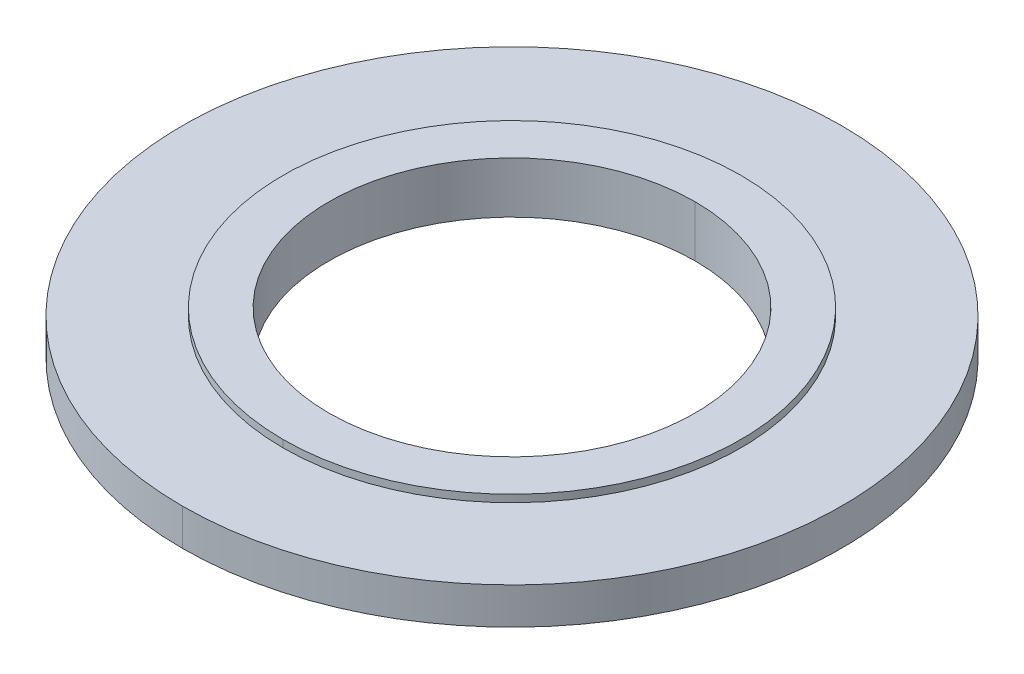
ISO-10303-21;
HEADER;
FILE_DESCRIPTION(('STEP AP214'),'2;1');
FILE_NAME('part.step','',(''),(''),'','','');
FILE_SCHEMA(('AUTOMOTIVE_DESIGN { 1 0 10303 214 1 1 1 1 }'));
ENDSEC;
DATA;
#1=APPLICATION_CONTEXT('core data for automotive mechanical design processes');
#2=APPLICATION_PROTOCOL_DEFINITION('international standard','automotive_design',2000,#1);
#3=PRODUCT_CONTEXT('',#1,'mechanical');
#4=PRODUCT('Part','Part','',(#3));
#5=PRODUCT_RELATED_PRODUCT_CATEGORY('part','',(#4));
#6=PRODUCT_DEFINITION_FORMATION('','',#4);
#7=PRODUCT_DEFINITION_CONTEXT('part definition',#1,'design');
#8=PRODUCT_DEFINITION('design','',#6,#7);
#9=PRODUCT_DEFINITION_SHAPE('','',#8);
#10=(LENGTH_UNIT() NAMED_UNIT(*) SI_UNIT(.MILLI.,.METRE.));
#11=(NAMED_UNIT(*) PLANE_ANGLE_UNIT() SI_UNIT($,.RADIAN.));
#12=(NAMED_UNIT(*) SI_UNIT($,.STERADIAN.) SOLID_ANGLE_UNIT());
#13=UNCERTAINTY_MEASURE_WITH_UNIT(LENGTH_MEASURE(1.E-05),#10,'distance_accuracy_value','');
#14=(GEOMETRIC_REPRESENTATION_CONTEXT(3) GLOBAL_UNCERTAINTY_ASSIGNED_CONTEXT((#13)) GLOBAL_UNIT_ASSIGNED_CONTEXT((#10,
#11,#12)) REPRESENTATION_CONTEXT('',''));
#15=CARTESIAN_POINT('',(0.,0.,0.));
#16=DIRECTION('',(0.,0.,1.));
#17=DIRECTION('',(1.,0.,0.));
#18=AXIS2_PLACEMENT_3D('',#15,#16,#17);
#19=CARTESIAN_POINT('',(0.,0.12,0.));
#20=DIRECTION('',(0.,-1.,0.));
#21=DIRECTION('',(0.,0.,-1.));
#22=AXIS2_PLACEMENT_3D('',#19,#20,#21);
#23=CYLINDRICAL_SURFACE('',#22,0.625);
#24=DIRECTION('',(0.,-1.,0.));
#25=VECTOR('',#24,1.);
#26=CARTESIAN_POINT('',(0.,0.12,0.625));
#27=LINE('',#26,#25);
#28=CARTESIAN_POINT('',(0.,0.12,0.625));
#29=VERTEX_POINT('',#28);
#30=CARTESIAN_POINT('',(0.,0.1,0.625));
#31=VERTEX_POINT('',#30);
#32=EDGE_CURVE('E176',#29,#31,#27,.T.);
#33=ORIENTED_EDGE('',*,*,#32,.F.);
#34=CARTESIAN_POINT('',(0.,0.12,0.));
#35=DIRECTION('',(0.,1.,0.));
#36=DIRECTION('',(0.,0.,-1.));
#37=AXIS2_PLACEMENT_3D('',#34,#35,#36);
#38=CIRCLE('',#37,0.625);
#39=CARTESIAN_POINT('',(0.,0.12,-0.625));
#40=VERTEX_POINT('',#39);
#41=EDGE_CURVE('E27',#40,#29,#38,.T.);
#42=ORIENTED_EDGE('',*,*,#41,.F.);
#43=DIRECTION('',(0.,-1.,0.));
#44=VECTOR('',#43,1.);
#45=CARTESIAN_POINT('',(0.,0.12,-0.625));
#46=LINE('',#45,#44);
#47=CARTESIAN_POINT('',(0.,0.1,-0.625));
#48=VERTEX_POINT('',#47);
#49=EDGE_CURVE('E167',#40,#48,#46,.T.);
#50=ORIENTED_EDGE('',*,*,#49,.T.);
#51=CARTESIAN_POINT('',(0.,0.1,0.));
#52=DIRECTION('',(0.,-1.,0.));
#53=DIRECTION('',(0.,0.,-1.));
#54=AXIS2_PLACEMENT_3D('',#51,#52,#53);
#55=CIRCLE('',#54,0.625);
#56=EDGE_CURVE('E11',#31,#48,#55,.T.);
#57=ORIENTED_EDGE('',*,*,#56,.F.);
#58=EDGE_LOOP('',(#33,#42,#50,#57));
#59=FACE_BOUND('',#58,.T.);
#60=ADVANCED_FACE('F16',(#59),#23,.T.);
#61=CARTESIAN_POINT('',(-0.91,0.1,-0.91));
#62=DIRECTION('',(0.,1.,0.));
#63=DIRECTION('',(1.,0.,0.));
#64=AXIS2_PLACEMENT_3D('',#61,#62,#63);
#65=PLANE('',#64);
#66=CARTESIAN_POINT('',(0.,0.1,0.));
#67=DIRECTION('',(0.,-1.,0.));
#68=DIRECTION('',(0.,0.,-1.));
#69=AXIS2_PLACEMENT_3D('',#66,#67,#68);
#70=CIRCLE('',#69,0.625);
#71=EDGE_CURVE('E170',#48,#31,#70,.T.);
#72=ORIENTED_EDGE('',*,*,#71,.T.);
#73=ORIENTED_EDGE('',*,*,#56,.T.);
#74=EDGE_LOOP('',(#72,#73));
#75=FACE_BOUND('',#74,.T.);
#76=CARTESIAN_POINT('',(0.,0.1,0.));
#77=DIRECTION('',(0.,-1.,0.));
#78=DIRECTION('',(0.,0.,-1.));
#79=AXIS2_PLACEMENT_3D('',#76,#77,#78);
#80=CIRCLE('',#79,0.9);
#81=CARTESIAN_POINT('',(0.,0.1,-0.9));
#82=VERTEX_POINT('',#81);
#83=CARTESIAN_POINT('',(0.,0.1,0.9));
#84=VERTEX_POINT('',#83);
#85=EDGE_CURVE('E144',#82,#84,#80,.T.);
#86=ORIENTED_EDGE('',*,*,#85,.F.);
#87=CARTESIAN_POINT('',(0.,0.1,0.));
#88=DIRECTION('',(0.,-1.,0.));
#89=DIRECTION('',(0.,0.,-1.));
#90=AXIS2_PLACEMENT_3D('',#87,#88,#89);
#91=CIRCLE('',#90,0.9);
#92=EDGE_CURVE('E119',#84,#82,#91,.T.);
#93=ORIENTED_EDGE('',*,*,#92,.F.);
#94=EDGE_LOOP('',(#86,#93));
#95=FACE_BOUND('',#94,.T.);
#96=ADVANCED_FACE('F231',(#75,#95),#65,.T.);
#97=CARTESIAN_POINT('',(-0.635,0.12,-0.635));
#98=DIRECTION('',(0.,1.,0.));
#99=DIRECTION('',(1.,0.,0.));
#100=AXIS2_PLACEMENT_3D('',#97,#98,#99);
#101=PLANE('',#100);
#102=CARTESIAN_POINT('',(0.,0.12,0.));
#103=DIRECTION('',(0.,1.,0.));
#104=DIRECTION('',(0.,0.,1.));
#105=AXIS2_PLACEMENT_3D('',#102,#103,#104);
#106=CIRCLE('',#105,0.5);
#107=CARTESIAN_POINT('',(0.,0.12,0.5));
#108=VERTEX_POINT('',#107);
#109=CARTESIAN_POINT('',(0.,0.12,-0.5));
#110=VERTEX_POINT('',#109);
#111=EDGE_CURVE('E126',#108,#110,#106,.T.);
#112=ORIENTED_EDGE('',*,*,#111,.F.);
#113=CARTESIAN_POINT('',(0.,0.12,0.));
#114=DIRECTION('',(0.,1.,0.));
#115=DIRECTION('',(0.,0.,1.));
#116=AXIS2_PLACEMENT_3D('',#113,#114,#115);
#117=CIRCLE('',#116,0.5);
#118=EDGE_CURVE('E129',#110,#108,#117,.T.);
#119=ORIENTED_EDGE('',*,*,#118,.F.);
#120=EDGE_LOOP('',(#112,#119));
#121=FACE_BOUND('',#120,.T.);
#122=ORIENTED_EDGE('',*,*,#41,.T.);
#123=CARTESIAN_POINT('',(0.,0.12,0.));
#124=DIRECTION('',(0.,1.,0.));
#125=DIRECTION('',(0.,0.,-1.));
#126=AXIS2_PLACEMENT_3D('',#123,#124,#125);
#127=CIRCLE('',#126,0.625);
#128=EDGE_CURVE('E166',#29,#40,#127,.T.);
#129=ORIENTED_EDGE('',*,*,#128,.T.);
#130=EDGE_LOOP('',(#122,#129));
#131=FACE_BOUND('',#130,.T.);
#132=ADVANCED_FACE('F18',(#121,#131),#101,.T.);
#133=CARTESIAN_POINT('',(0.,0.1,0.));
#134=DIRECTION('',(0.,-1.,0.));
#135=DIRECTION('',(0.,0.,-1.));
#136=AXIS2_PLACEMENT_3D('',#133,#134,#135);
#137=CYLINDRICAL_SURFACE('',#136,0.9);
#138=DIRECTION('',(0.,-1.,0.));
#139=VECTOR('',#138,1.);
#140=CARTESIAN_POINT('',(0.,0.1,0.9));
#141=LINE('',#140,#139);
#142=CARTESIAN_POINT('',(0.,0.,0.9));
#143=VERTEX_POINT('',#142);
#144=EDGE_CURVE('E171',#84,#143,#141,.T.);
#145=ORIENTED_EDGE('',*,*,#144,.F.);
#146=ORIENTED_EDGE('',*,*,#92,.T.);
#147=DIRECTION('',(0.,-1.,0.));
#148=VECTOR('',#147,1.);
#149=CARTESIAN_POINT('',(0.,0.1,-0.9));
#150=LINE('',#149,#148);
#151=CARTESIAN_POINT('',(0.,0.,-0.9));
#152=VERTEX_POINT('',#151);
#153=EDGE_CURVE('E163',#82,#152,#150,.T.);
#154=ORIENTED_EDGE('',*,*,#153,.T.);
#155=CARTESIAN_POINT('',(0.,0.,0.));
#156=DIRECTION('',(0.,-1.,0.));
#157=DIRECTION('',(0.,0.,-1.));
#158=AXIS2_PLACEMENT_3D('',#155,#156,#157);
#159=CIRCLE('',#158,0.9);
#160=EDGE_CURVE('E70',#143,#152,#159,.T.);
#161=ORIENTED_EDGE('',*,*,#160,.F.);
#162=EDGE_LOOP('',(#145,#146,#154,#161));
#163=FACE_BOUND('',#162,.T.);
#164=ADVANCED_FACE('F240',(#163),#137,.T.);
#165=CARTESIAN_POINT('',(0.,-0.02,0.));
#166=DIRECTION('',(0.,1.,0.));
#167=DIRECTION('',(0.,0.,1.));
#168=AXIS2_PLACEMENT_3D('',#165,#166,#167);
#169=CYLINDRICAL_SURFACE('',#168,0.5);
#170=DIRECTION('',(0.,1.,0.));
#171=VECTOR('',#170,1.);
#172=CARTESIAN_POINT('',(0.,-0.02,-0.5));
#173=LINE('',#172,#171);
#174=CARTESIAN_POINT('',(0.,-0.02,-0.5));
#175=VERTEX_POINT('',#174);
#176=EDGE_CURVE('E147',#175,#110,#173,.T.);
#177=ORIENTED_EDGE('',*,*,#176,.F.);
#178=CARTESIAN_POINT('',(0.,-0.02,0.));
#179=DIRECTION('',(0.,1.,0.));
#180=DIRECTION('',(0.,0.,1.));
#181=AXIS2_PLACEMENT_3D('',#178,#179,#180);
#182=CIRCLE('',#181,0.5);
#183=CARTESIAN_POINT('',(0.,-0.02,0.5));
#184=VERTEX_POINT('',#183);
#185=EDGE_CURVE('E139',#184,#175,#182,.T.);
#186=ORIENTED_EDGE('',*,*,#185,.F.);
#187=DIRECTION('',(0.,1.,0.));
#188=VECTOR('',#187,1.);
#189=CARTESIAN_POINT('',(0.,-0.02,0.5));
#190=LINE('',#189,#188);
#191=EDGE_CURVE('E136',#184,#108,#190,.T.);
#192=ORIENTED_EDGE('',*,*,#191,.T.);
#193=ORIENTED_EDGE('',*,*,#111,.T.);
#194=EDGE_LOOP('',(#177,#186,#192,#193));
#195=FACE_BOUND('',#194,.T.);
#196=ADVANCED_FACE('F137',(#195),#169,.F.);
#197=CARTESIAN_POINT('',(-0.91,0.,0.91));
#198=DIRECTION('',(0.,-1.,0.));
#199=DIRECTION('',(0.,0.,-1.));
#200=AXIS2_PLACEMENT_3D('',#197,#198,#199);
#201=PLANE('',#200);
#202=CARTESIAN_POINT('',(0.,0.,0.));
#203=DIRECTION('',(0.,-1.,0.));
#204=DIRECTION('',(0.,0.,-1.));
#205=AXIS2_PLACEMENT_3D('',#202,#203,#204);
#206=CIRCLE('',#205,0.625);
#207=CARTESIAN_POINT('',(0.,0.,-0.625));
#208=VERTEX_POINT('',#207);
#209=CARTESIAN_POINT('',(0.,0.,0.625));
#210=VERTEX_POINT('',#209);
#211=EDGE_CURVE('E160',#208,#210,#206,.T.);
#212=ORIENTED_EDGE('',*,*,#211,.F.);
#213=CARTESIAN_POINT('',(0.,0.,0.));
#214=DIRECTION('',(0.,-1.,0.));
#215=DIRECTION('',(0.,0.,-1.));
#216=AXIS2_PLACEMENT_3D('',#213,#214,#215);
#217=CIRCLE('',#216,0.625);
#218=EDGE_CURVE('E101',#210,#208,#217,.T.);
#219=ORIENTED_EDGE('',*,*,#218,.F.);
#220=EDGE_LOOP('',(#212,#219));
#221=FACE_BOUND('',#220,.T.);
#222=CARTESIAN_POINT('',(0.,0.,0.));
#223=DIRECTION('',(0.,-1.,0.));
#224=DIRECTION('',(0.,0.,-1.));
#225=AXIS2_PLACEMENT_3D('',#222,#223,#224);
#226=CIRCLE('',#225,0.9);
#227=EDGE_CURVE('E20',#152,#143,#226,.T.);
#228=ORIENTED_EDGE('',*,*,#227,.T.);
#229=ORIENTED_EDGE('',*,*,#160,.T.);
#230=EDGE_LOOP('',(#228,#229));
#231=FACE_BOUND('',#230,.T.);
#232=ADVANCED_FACE('F212',(#221,#231),#201,.T.);
#233=CARTESIAN_POINT('',(-0.635,-0.02,0.635));
#234=DIRECTION('',(0.,-1.,0.));
#235=DIRECTION('',(0.,0.,-1.));
#236=AXIS2_PLACEMENT_3D('',#233,#234,#235);
#237=PLANE('',#236);
#238=ORIENTED_EDGE('',*,*,#185,.T.);
#239=CARTESIAN_POINT('',(0.,-0.02,0.));
#240=DIRECTION('',(0.,1.,0.));
#241=DIRECTION('',(0.,0.,1.));
#242=AXIS2_PLACEMENT_3D('',#239,#240,#241);
#243=CIRCLE('',#242,0.5);
#244=EDGE_CURVE('E155',#175,#184,#243,.T.);
#245=ORIENTED_EDGE('',*,*,#244,.T.);
#246=EDGE_LOOP('',(#238,#245));
#247=FACE_BOUND('',#246,.T.);
#248=CARTESIAN_POINT('',(0.,-0.02,0.));
#249=DIRECTION('',(0.,1.,0.));
#250=DIRECTION('',(0.,0.,-1.));
#251=AXIS2_PLACEMENT_3D('',#248,#249,#250);
#252=CIRCLE('',#251,0.625);
#253=CARTESIAN_POINT('',(0.,-0.02,-0.625));
#254=VERTEX_POINT('',#253);
#255=CARTESIAN_POINT('',(0.,-0.02,0.625));
#256=VERTEX_POINT('',#255);
#257=EDGE_CURVE('E184',#254,#256,#252,.T.);
#258=ORIENTED_EDGE('',*,*,#257,.F.);
#259=CARTESIAN_POINT('',(0.,-0.02,0.));
#260=DIRECTION('',(0.,1.,0.));
#261=DIRECTION('',(0.,0.,-1.));
#262=AXIS2_PLACEMENT_3D('',#259,#260,#261);
#263=CIRCLE('',#262,0.625);
#264=EDGE_CURVE('E180',#256,#254,#263,.T.);
#265=ORIENTED_EDGE('',*,*,#264,.F.);
#266=EDGE_LOOP('',(#258,#265));
#267=FACE_BOUND('',#266,.T.);
#268=ADVANCED_FACE('F217',(#247,#267),#237,.T.);
#269=CARTESIAN_POINT('',(0.,0.,0.));
#270=DIRECTION('',(0.,-1.,0.));
#271=DIRECTION('',(0.,0.,-1.));
#272=AXIS2_PLACEMENT_3D('',#269,#270,#271);
#273=CYLINDRICAL_SURFACE('',#272,0.625);
#274=DIRECTION('',(0.,-1.,0.));
#275=VECTOR('',#274,1.);
#276=CARTESIAN_POINT('',(0.,0.,0.625));
#277=LINE('',#276,#275);
#278=EDGE_CURVE('E159',#210,#256,#277,.T.);
#279=ORIENTED_EDGE('',*,*,#278,.F.);
#280=ORIENTED_EDGE('',*,*,#218,.T.);
#281=DIRECTION('',(0.,-1.,0.));
#282=VECTOR('',#281,1.);
#283=CARTESIAN_POINT('',(0.,0.,-0.625));
#284=LINE('',#283,#282);
#285=EDGE_CURVE('E178',#208,#254,#284,.T.);
#286=ORIENTED_EDGE('',*,*,#285,.T.);
#287=ORIENTED_EDGE('',*,*,#257,.T.);
#288=EDGE_LOOP('',(#279,#280,#286,#287));
#289=FACE_BOUND('',#288,.T.);
#290=ADVANCED_FACE('F258',(#289),#273,.T.);
#291=CARTESIAN_POINT('',(0.,0.12,0.));
#292=DIRECTION('',(0.,-1.,0.));
#293=DIRECTION('',(0.,0.,-1.));
#294=AXIS2_PLACEMENT_3D('',#291,#292,#293);
#295=CYLINDRICAL_SURFACE('',#294,0.625);
#296=ORIENTED_EDGE('',*,*,#128,.F.);
#297=ORIENTED_EDGE('',*,*,#32,.T.);
#298=ORIENTED_EDGE('',*,*,#71,.F.);
#299=ORIENTED_EDGE('',*,*,#49,.F.);
#300=EDGE_LOOP('',(#296,#297,#298,#299));
#301=FACE_BOUND('',#300,.T.);
#302=ADVANCED_FACE('F252',(#301),#295,.T.);
#303=CARTESIAN_POINT('',(0.,0.1,0.));
#304=DIRECTION('',(0.,-1.,0.));
#305=DIRECTION('',(0.,0.,-1.));
#306=AXIS2_PLACEMENT_3D('',#303,#304,#305);
#307=CYLINDRICAL_SURFACE('',#306,0.9);
#308=ORIENTED_EDGE('',*,*,#85,.T.);
#309=ORIENTED_EDGE('',*,*,#144,.T.);
#310=ORIENTED_EDGE('',*,*,#227,.F.);
#311=ORIENTED_EDGE('',*,*,#153,.F.);
#312=EDGE_LOOP('',(#308,#309,#310,#311));
#313=FACE_BOUND('',#312,.T.);
#314=ADVANCED_FACE('F257',(#313),#307,.T.);
#315=CARTESIAN_POINT('',(0.,-0.02,0.));
#316=DIRECTION('',(0.,1.,0.));
#317=DIRECTION('',(0.,0.,1.));
#318=AXIS2_PLACEMENT_3D('',#315,#316,#317);
#319=CYLINDRICAL_SURFACE('',#318,0.5);
#320=ORIENTED_EDGE('',*,*,#244,.F.);
#321=ORIENTED_EDGE('',*,*,#176,.T.);
#322=ORIENTED_EDGE('',*,*,#118,.T.);
#323=ORIENTED_EDGE('',*,*,#191,.F.);
#324=EDGE_LOOP('',(#320,#321,#322,#323));
#325=FACE_BOUND('',#324,.T.);
#326=ADVANCED_FACE('F146',(#325),#319,.F.);
#327=CARTESIAN_POINT('',(0.,0.,0.));
#328=DIRECTION('',(0.,-1.,0.));
#329=DIRECTION('',(0.,0.,-1.));
#330=AXIS2_PLACEMENT_3D('',#327,#328,#329);
#331=CYLINDRICAL_SURFACE('',#330,0.625);
#332=ORIENTED_EDGE('',*,*,#211,.T.);
#333=ORIENTED_EDGE('',*,*,#278,.T.);
#334=ORIENTED_EDGE('',*,*,#264,.T.);
#335=ORIENTED_EDGE('',*,*,#285,.F.);
#336=EDGE_LOOP('',(#332,#333,#334,#335));
#337=FACE_BOUND('',#336,.T.);
#338=ADVANCED_FACE('F291',(#337),#331,.T.);
#339=CLOSED_SHELL('',(#60,#96,#132,#164,#196,#232,#268,#290,#302,#314,#326,#338));
#340=MANIFOLD_SOLID_BREP('B1',#339);
#341=ADVANCED_BREP_SHAPE_REPRESENTATION('',(#18,#340),#14);
#342=SHAPE_DEFINITION_REPRESENTATION(#9,#341);
ENDSEC;
END-ISO-10303-21;
